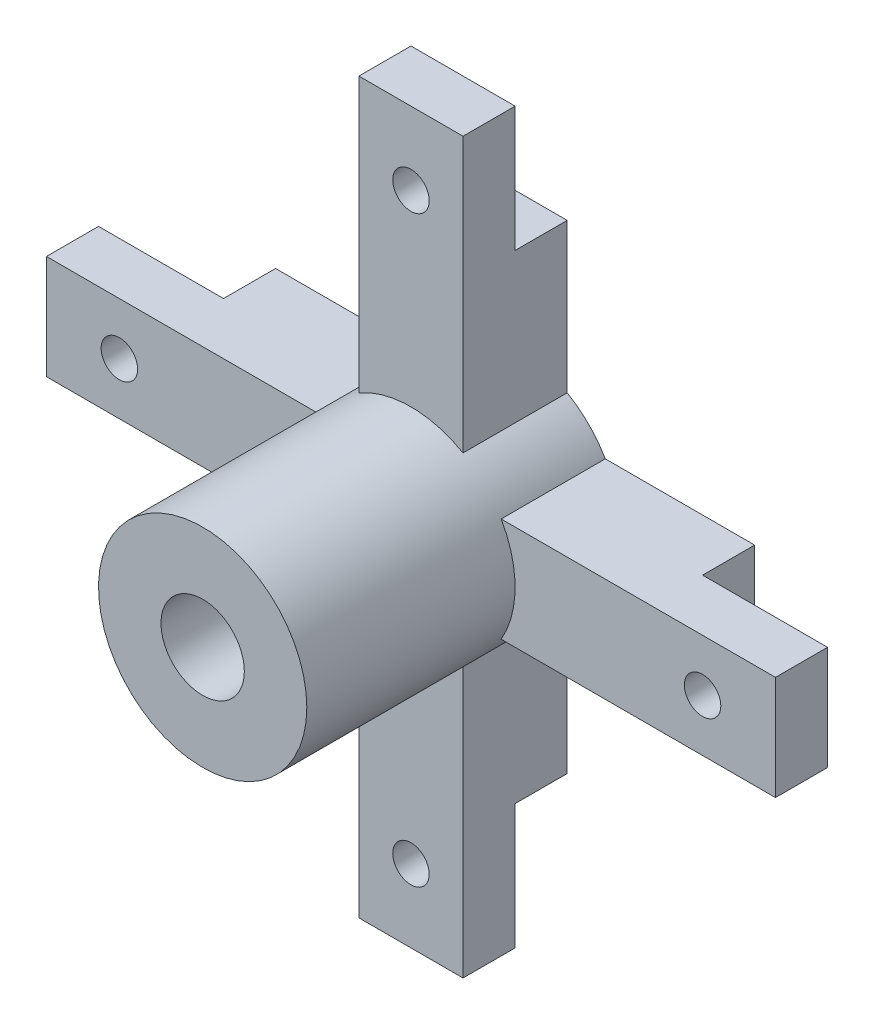
ISO-10303-21;
HEADER;
FILE_DESCRIPTION(('STEP AP214'),'2;1');
FILE_NAME('part.step','',(''),(''),'','','');
FILE_SCHEMA(('AUTOMOTIVE_DESIGN { 1 0 10303 214 1 1 1 1 }'));
ENDSEC;
DATA;
#1=APPLICATION_CONTEXT('core data for automotive mechanical design processes');
#2=APPLICATION_PROTOCOL_DEFINITION('international standard','automotive_design',2000,#1);
#3=PRODUCT_CONTEXT('',#1,'mechanical');
#4=PRODUCT('Part','Part','',(#3));
#5=PRODUCT_RELATED_PRODUCT_CATEGORY('part','',(#4));
#6=PRODUCT_DEFINITION_FORMATION('','',#4);
#7=PRODUCT_DEFINITION_CONTEXT('part definition',#1,'design');
#8=PRODUCT_DEFINITION('design','',#6,#7);
#9=PRODUCT_DEFINITION_SHAPE('','',#8);
#10=(LENGTH_UNIT() NAMED_UNIT(*) SI_UNIT(.MILLI.,.METRE.));
#11=(NAMED_UNIT(*) PLANE_ANGLE_UNIT() SI_UNIT($,.RADIAN.));
#12=(NAMED_UNIT(*) SI_UNIT($,.STERADIAN.) SOLID_ANGLE_UNIT());
#13=UNCERTAINTY_MEASURE_WITH_UNIT(LENGTH_MEASURE(1.E-05),#10,'distance_accuracy_value','');
#14=(GEOMETRIC_REPRESENTATION_CONTEXT(3) GLOBAL_UNCERTAINTY_ASSIGNED_CONTEXT((#13)) GLOBAL_UNIT_ASSIGNED_CONTEXT((#10,
#11,#12)) REPRESENTATION_CONTEXT('',''));
#15=CARTESIAN_POINT('',(0.,0.,0.));
#16=DIRECTION('',(0.,0.,1.));
#17=DIRECTION('',(1.,0.,0.));
#18=AXIS2_PLACEMENT_3D('',#15,#16,#17);
#19=CARTESIAN_POINT('',(0.,0.,30.));
#20=DIRECTION('',(0.,0.,1.));
#21=DIRECTION('',(1.,0.,0.));
#22=AXIS2_PLACEMENT_3D('',#19,#20,#21);
#23=PLANE('',#22);
#24=CARTESIAN_POINT('',(0.,0.,30.));
#25=DIRECTION('',(0.,0.,1.));
#26=DIRECTION('',(1.,0.,0.));
#27=AXIS2_PLACEMENT_3D('',#24,#25,#26);
#28=CIRCLE('',#27,10.);
#29=CARTESIAN_POINT('',(10.,0.,30.));
#30=VERTEX_POINT('',#29);
#31=EDGE_CURVE('E298',#30,#30,#28,.T.);
#32=ORIENTED_EDGE('',*,*,#31,.T.);
#33=EDGE_LOOP('',(#32));
#34=FACE_BOUND('',#33,.T.);
#35=CARTESIAN_POINT('',(0.,0.,30.));
#36=DIRECTION('',(0.,0.,1.));
#37=DIRECTION('',(1.,0.,0.));
#38=AXIS2_PLACEMENT_3D('',#35,#36,#37);
#39=CIRCLE('',#38,4.);
#40=CARTESIAN_POINT('',(4.,0.,30.));
#41=VERTEX_POINT('',#40);
#42=EDGE_CURVE('E292',#41,#41,#39,.T.);
#43=ORIENTED_EDGE('',*,*,#42,.F.);
#44=EDGE_LOOP('',(#43));
#45=FACE_BOUND('',#44,.T.);
#46=ADVANCED_FACE('F35',(#34,#45),#23,.T.);
#47=CARTESIAN_POINT('',(0.,0.,0.));
#48=DIRECTION('',(0.,0.,1.));
#49=DIRECTION('',(1.,0.,0.));
#50=AXIS2_PLACEMENT_3D('',#47,#48,#49);
#51=PLANE('',#50);
#52=CARTESIAN_POINT('',(0.,0.,0.));
#53=DIRECTION('',(0.,0.,1.));
#54=DIRECTION('',(1.,0.,0.));
#55=AXIS2_PLACEMENT_3D('',#52,#53,#54);
#56=CIRCLE('',#55,4.);
#57=CARTESIAN_POINT('',(4.,0.,0.));
#58=VERTEX_POINT('',#57);
#59=EDGE_CURVE('E291',#58,#58,#56,.T.);
#60=ORIENTED_EDGE('',*,*,#59,.T.);
#61=EDGE_LOOP('',(#60));
#62=FACE_BOUND('',#61,.T.);
#63=DIRECTION('',(0.,-1.,0.));
#64=VECTOR('',#63,1.);
#65=CARTESIAN_POINT('',(5.,-4.,0.));
#66=LINE('',#65,#64);
#67=CARTESIAN_POINT('',(5.,-8.66025403784439,0.));
#68=VERTEX_POINT('',#67);
#69=CARTESIAN_POINT('',(5.,-23.,0.));
#70=VERTEX_POINT('',#69);
#71=EDGE_CURVE('E411',#68,#70,#66,.T.);
#72=ORIENTED_EDGE('',*,*,#71,.T.);
#73=DIRECTION('',(1.,0.,0.));
#74=VECTOR('',#73,1.);
#75=CARTESIAN_POINT('',(-5.,-23.,0.));
#76=LINE('',#75,#74);
#77=CARTESIAN_POINT('',(-5.,-23.,0.));
#78=VERTEX_POINT('',#77);
#79=EDGE_CURVE('E203',#78,#70,#76,.T.);
#80=ORIENTED_EDGE('',*,*,#79,.F.);
#81=DIRECTION('',(0.,1.,0.));
#82=VECTOR('',#81,1.);
#83=CARTESIAN_POINT('',(-5.,-4.,0.));
#84=LINE('',#83,#82);
#85=CARTESIAN_POINT('',(-5.,-8.66025403784439,0.));
#86=VERTEX_POINT('',#85);
#87=EDGE_CURVE('E415',#78,#86,#84,.T.);
#88=ORIENTED_EDGE('',*,*,#87,.T.);
#89=CARTESIAN_POINT('',(0.,0.,0.));
#90=DIRECTION('',(0.,0.,1.));
#91=DIRECTION('',(1.,0.,0.));
#92=AXIS2_PLACEMENT_3D('',#89,#90,#91);
#93=CIRCLE('',#92,10.);
#94=CARTESIAN_POINT('',(-8.66025403784437,-5.00000000000003,0.));
#95=VERTEX_POINT('',#94);
#96=EDGE_CURVE('E305',#95,#86,#93,.T.);
#97=ORIENTED_EDGE('',*,*,#96,.F.);
#98=DIRECTION('',(-1.,0.,0.));
#99=VECTOR('',#98,1.);
#100=CARTESIAN_POINT('',(-3.99999999999998,-5.00000000000001,0.));
#101=LINE('',#100,#99);
#102=CARTESIAN_POINT('',(-23.,-5.00000000000008,0.));
#103=VERTEX_POINT('',#102);
#104=EDGE_CURVE('E220',#95,#103,#101,.T.);
#105=ORIENTED_EDGE('',*,*,#104,.T.);
#106=DIRECTION('',(0.,-1.,0.));
#107=VECTOR('',#106,1.);
#108=CARTESIAN_POINT('',(-23.,4.99999999999992,0.));
#109=LINE('',#108,#107);
#110=CARTESIAN_POINT('',(-23.,4.99999999999992,0.));
#111=VERTEX_POINT('',#110);
#112=EDGE_CURVE('E384',#111,#103,#109,.T.);
#113=ORIENTED_EDGE('',*,*,#112,.F.);
#114=DIRECTION('',(1.,0.,0.));
#115=VECTOR('',#114,1.);
#116=CARTESIAN_POINT('',(-4.00000000000002,4.99999999999999,0.));
#117=LINE('',#116,#115);
#118=CARTESIAN_POINT('',(-8.6602540378444,4.99999999999997,0.));
#119=VERTEX_POINT('',#118);
#120=EDGE_CURVE('E229',#111,#119,#117,.T.);
#121=ORIENTED_EDGE('',*,*,#120,.T.);
#122=CARTESIAN_POINT('',(-5.,8.66025403784439,0.));
#123=VERTEX_POINT('',#122);
#124=EDGE_CURVE('E302',#123,#119,#93,.T.);
#125=ORIENTED_EDGE('',*,*,#124,.F.);
#126=DIRECTION('',(0.,1.,0.));
#127=VECTOR('',#126,1.);
#128=CARTESIAN_POINT('',(-5.,4.,0.));
#129=LINE('',#128,#127);
#130=CARTESIAN_POINT('',(-5.,23.,0.));
#131=VERTEX_POINT('',#130);
#132=EDGE_CURVE('E268',#123,#131,#129,.T.);
#133=ORIENTED_EDGE('',*,*,#132,.T.);
#134=DIRECTION('',(-1.,0.,0.));
#135=VECTOR('',#134,1.);
#136=CARTESIAN_POINT('',(5.,23.,0.));
#137=LINE('',#136,#135);
#138=CARTESIAN_POINT('',(5.,23.,0.));
#139=VERTEX_POINT('',#138);
#140=EDGE_CURVE('E256',#139,#131,#137,.T.);
#141=ORIENTED_EDGE('',*,*,#140,.F.);
#142=DIRECTION('',(0.,-1.,0.));
#143=VECTOR('',#142,1.);
#144=CARTESIAN_POINT('',(5.,4.,0.));
#145=LINE('',#144,#143);
#146=CARTESIAN_POINT('',(5.,8.66025403784439,0.));
#147=VERTEX_POINT('',#146);
#148=EDGE_CURVE('E273',#139,#147,#145,.T.);
#149=ORIENTED_EDGE('',*,*,#148,.T.);
#150=CARTESIAN_POINT('',(8.66025403784433,5.00000000000009,0.));
#151=VERTEX_POINT('',#150);
#152=EDGE_CURVE('E295',#151,#147,#93,.T.);
#153=ORIENTED_EDGE('',*,*,#152,.F.);
#154=DIRECTION('',(1.,0.,0.));
#155=VECTOR('',#154,1.);
#156=CARTESIAN_POINT('',(3.99999999999995,5.00000000000004,0.));
#157=LINE('',#156,#155);
#158=CARTESIAN_POINT('',(22.9999999999999,5.00000000000024,0.));
#159=VERTEX_POINT('',#158);
#160=EDGE_CURVE('E391',#151,#159,#157,.T.);
#161=ORIENTED_EDGE('',*,*,#160,.T.);
#162=DIRECTION('',(0.,1.,0.));
#163=VECTOR('',#162,1.);
#164=CARTESIAN_POINT('',(23.0000000000001,-4.99999999999976,0.));
#165=LINE('',#164,#163);
#166=CARTESIAN_POINT('',(23.0000000000001,-4.99999999999976,0.));
#167=VERTEX_POINT('',#166);
#168=EDGE_CURVE('E429',#167,#159,#165,.T.);
#169=ORIENTED_EDGE('',*,*,#168,.F.);
#170=DIRECTION('',(-1.,0.,0.));
#171=VECTOR('',#170,1.);
#172=CARTESIAN_POINT('',(4.00000000000005,-4.99999999999996,0.));
#173=LINE('',#172,#171);
#174=CARTESIAN_POINT('',(8.66025403784444,-4.99999999999991,0.));
#175=VERTEX_POINT('',#174);
#176=EDGE_CURVE('E400',#167,#175,#173,.T.);
#177=ORIENTED_EDGE('',*,*,#176,.T.);
#178=EDGE_CURVE('E354',#68,#175,#93,.T.);
#179=ORIENTED_EDGE('',*,*,#178,.F.);
#180=EDGE_LOOP('',(#72,#80,#88,#97,#105,#113,#121,#125,#133,#141,#149,#153,#161,#169,#177,#179));
#181=FACE_BOUND('',#180,.T.);
#182=ADVANCED_FACE('F364',(#62,#181),#51,.F.);
#183=CARTESIAN_POINT('',(0.,0.,30.));
#184=DIRECTION('',(0.,0.,-1.));
#185=DIRECTION('',(-1.,0.,0.));
#186=AXIS2_PLACEMENT_3D('',#183,#184,#185);
#187=CYLINDRICAL_SURFACE('',#186,10.);
#188=ORIENTED_EDGE('',*,*,#31,.F.);
#189=EDGE_LOOP('',(#188));
#190=FACE_BOUND('',#189,.T.);
#191=CARTESIAN_POINT('',(0.,0.,10.));
#192=DIRECTION('',(0.,0.,1.));
#193=DIRECTION('',(1.,0.,0.));
#194=AXIS2_PLACEMENT_3D('',#191,#192,#193);
#195=CIRCLE('',#194,10.);
#196=CARTESIAN_POINT('',(-8.6602540378444,4.99999999999997,10.));
#197=VERTEX_POINT('',#196);
#198=CARTESIAN_POINT('',(-8.66025403784437,-5.00000000000003,10.));
#199=VERTEX_POINT('',#198);
#200=EDGE_CURVE('E248',#197,#199,#195,.T.);
#201=ORIENTED_EDGE('',*,*,#200,.T.);
#202=DIRECTION('',(0.,0.,-1.));
#203=VECTOR('',#202,1.);
#204=CARTESIAN_POINT('',(-8.66025403784437,-5.00000000000003,30.));
#205=LINE('',#204,#203);
#206=EDGE_CURVE('E11',#199,#95,#205,.T.);
#207=ORIENTED_EDGE('',*,*,#206,.T.);
#208=ORIENTED_EDGE('',*,*,#96,.T.);
#209=DIRECTION('',(0.,0.,-1.));
#210=VECTOR('',#209,1.);
#211=CARTESIAN_POINT('',(-5.,-8.66025403784439,30.));
#212=LINE('',#211,#210);
#213=CARTESIAN_POINT('',(-5.,-8.66025403784439,10.));
#214=VERTEX_POINT('',#213);
#215=EDGE_CURVE('E318',#86,#214,#212,.F.);
#216=ORIENTED_EDGE('',*,*,#215,.T.);
#217=CARTESIAN_POINT('',(5.,-8.66025403784439,10.));
#218=VERTEX_POINT('',#217);
#219=EDGE_CURVE('E247',#214,#218,#195,.T.);
#220=ORIENTED_EDGE('',*,*,#219,.T.);
#221=DIRECTION('',(0.,0.,-1.));
#222=VECTOR('',#221,1.);
#223=CARTESIAN_POINT('',(5.,-8.66025403784439,30.));
#224=LINE('',#223,#222);
#225=EDGE_CURVE('E321',#218,#68,#224,.T.);
#226=ORIENTED_EDGE('',*,*,#225,.T.);
#227=ORIENTED_EDGE('',*,*,#178,.T.);
#228=DIRECTION('',(0.,0.,-1.));
#229=VECTOR('',#228,1.);
#230=CARTESIAN_POINT('',(8.66025403784444,-4.99999999999991,30.));
#231=LINE('',#230,#229);
#232=CARTESIAN_POINT('',(8.66025403784444,-4.99999999999991,10.));
#233=VERTEX_POINT('',#232);
#234=EDGE_CURVE('E310',#175,#233,#231,.F.);
#235=ORIENTED_EDGE('',*,*,#234,.T.);
#236=CARTESIAN_POINT('',(8.66025403784433,5.00000000000009,10.));
#237=VERTEX_POINT('',#236);
#238=EDGE_CURVE('E242',#233,#237,#195,.T.);
#239=ORIENTED_EDGE('',*,*,#238,.T.);
#240=DIRECTION('',(0.,0.,-1.));
#241=VECTOR('',#240,1.);
#242=CARTESIAN_POINT('',(8.66025403784433,5.00000000000009,30.));
#243=LINE('',#242,#241);
#244=EDGE_CURVE('E315',#237,#151,#243,.T.);
#245=ORIENTED_EDGE('',*,*,#244,.T.);
#246=ORIENTED_EDGE('',*,*,#152,.T.);
#247=DIRECTION('',(0.,0.,-1.));
#248=VECTOR('',#247,1.);
#249=CARTESIAN_POINT('',(5.,8.66025403784439,30.));
#250=LINE('',#249,#248);
#251=CARTESIAN_POINT('',(5.,8.66025403784439,10.));
#252=VERTEX_POINT('',#251);
#253=EDGE_CURVE('E301',#147,#252,#250,.F.);
#254=ORIENTED_EDGE('',*,*,#253,.T.);
#255=CARTESIAN_POINT('',(0.,0.,10.));
#256=DIRECTION('',(0.,0.,1.));
#257=DIRECTION('',(1.,0.,0.));
#258=AXIS2_PLACEMENT_3D('',#255,#256,#257);
#259=CIRCLE('',#258,10.);
#260=CARTESIAN_POINT('',(-5.,8.66025403784439,10.));
#261=VERTEX_POINT('',#260);
#262=EDGE_CURVE('E287',#252,#261,#259,.T.);
#263=ORIENTED_EDGE('',*,*,#262,.T.);
#264=DIRECTION('',(0.,0.,-1.));
#265=VECTOR('',#264,1.);
#266=CARTESIAN_POINT('',(-5.,8.66025403784439,30.));
#267=LINE('',#266,#265);
#268=EDGE_CURVE('E307',#261,#123,#267,.T.);
#269=ORIENTED_EDGE('',*,*,#268,.T.);
#270=ORIENTED_EDGE('',*,*,#124,.T.);
#271=DIRECTION('',(0.,0.,-1.));
#272=VECTOR('',#271,1.);
#273=CARTESIAN_POINT('',(-8.6602540378444,4.99999999999997,30.));
#274=LINE('',#273,#272);
#275=EDGE_CURVE('E44',#119,#197,#274,.F.);
#276=ORIENTED_EDGE('',*,*,#275,.T.);
#277=EDGE_LOOP('',(#201,#207,#208,#216,#220,#226,#227,#235,#239,#245,#246,#254,#263,#269,#270,#276));
#278=FACE_BOUND('',#277,.T.);
#279=ADVANCED_FACE('F37',(#190,#278),#187,.T.);
#280=CARTESIAN_POINT('',(0.,0.,30.));
#281=DIRECTION('',(0.,0.,-1.));
#282=DIRECTION('',(-1.,0.,0.));
#283=AXIS2_PLACEMENT_3D('',#280,#281,#282);
#284=CYLINDRICAL_SURFACE('',#283,4.);
#285=ORIENTED_EDGE('',*,*,#59,.F.);
#286=EDGE_LOOP('',(#285));
#287=FACE_BOUND('',#286,.T.);
#288=ORIENTED_EDGE('',*,*,#42,.T.);
#289=EDGE_LOOP('',(#288));
#290=FACE_BOUND('',#289,.T.);
#291=ADVANCED_FACE('F514',(#287,#290),#284,.F.);
#292=CARTESIAN_POINT('',(-5.,4.,10.));
#293=DIRECTION('',(-1.,0.,0.));
#294=DIRECTION('',(0.,0.,1.));
#295=AXIS2_PLACEMENT_3D('',#292,#293,#294);
#296=PLANE('',#295);
#297=DIRECTION('',(0.,0.,-1.));
#298=VECTOR('',#297,1.);
#299=CARTESIAN_POINT('',(-5.,23.,5.));
#300=LINE('',#299,#298);
#301=CARTESIAN_POINT('',(-5.,23.,5.));
#302=VERTEX_POINT('',#301);
#303=EDGE_CURVE('E265',#302,#131,#300,.T.);
#304=ORIENTED_EDGE('',*,*,#303,.T.);
#305=ORIENTED_EDGE('',*,*,#132,.F.);
#306=ORIENTED_EDGE('',*,*,#268,.F.);
#307=DIRECTION('',(0.,1.,0.));
#308=VECTOR('',#307,1.);
#309=CARTESIAN_POINT('',(-5.,4.,10.));
#310=LINE('',#309,#308);
#311=CARTESIAN_POINT('',(-5.,35.,10.));
#312=VERTEX_POINT('',#311);
#313=EDGE_CURVE('E270',#261,#312,#310,.T.);
#314=ORIENTED_EDGE('',*,*,#313,.T.);
#315=DIRECTION('',(0.,0.,-1.));
#316=VECTOR('',#315,1.);
#317=CARTESIAN_POINT('',(-5.,35.,10.));
#318=LINE('',#317,#316);
#319=CARTESIAN_POINT('',(-5.,35.,5.));
#320=VERTEX_POINT('',#319);
#321=EDGE_CURVE('E279',#312,#320,#318,.T.);
#322=ORIENTED_EDGE('',*,*,#321,.T.);
#323=DIRECTION('',(0.,1.,0.));
#324=VECTOR('',#323,1.);
#325=CARTESIAN_POINT('',(-5.,23.,5.));
#326=LINE('',#325,#324);
#327=EDGE_CURVE('E253',#302,#320,#326,.T.);
#328=ORIENTED_EDGE('',*,*,#327,.F.);
#329=EDGE_LOOP('',(#304,#305,#306,#314,#322,#328));
#330=FACE_BOUND('',#329,.T.);
#331=ADVANCED_FACE('F380',(#330),#296,.T.);
#332=CARTESIAN_POINT('',(5.,4.,10.));
#333=DIRECTION('',(1.,0.,0.));
#334=DIRECTION('',(0.,0.,-1.));
#335=AXIS2_PLACEMENT_3D('',#332,#333,#334);
#336=PLANE('',#335);
#337=DIRECTION('',(0.,0.,-1.));
#338=VECTOR('',#337,1.);
#339=CARTESIAN_POINT('',(5.,23.,5.));
#340=LINE('',#339,#338);
#341=CARTESIAN_POINT('',(5.,23.,5.));
#342=VERTEX_POINT('',#341);
#343=EDGE_CURVE('E263',#342,#139,#340,.T.);
#344=ORIENTED_EDGE('',*,*,#343,.F.);
#345=DIRECTION('',(0.,-1.,0.));
#346=VECTOR('',#345,1.);
#347=CARTESIAN_POINT('',(5.,23.,5.));
#348=LINE('',#347,#346);
#349=CARTESIAN_POINT('',(5.,35.,5.));
#350=VERTEX_POINT('',#349);
#351=EDGE_CURVE('E258',#350,#342,#348,.T.);
#352=ORIENTED_EDGE('',*,*,#351,.F.);
#353=DIRECTION('',(0.,0.,-1.));
#354=VECTOR('',#353,1.);
#355=CARTESIAN_POINT('',(5.,35.,10.));
#356=LINE('',#355,#354);
#357=CARTESIAN_POINT('',(5.,35.,10.));
#358=VERTEX_POINT('',#357);
#359=EDGE_CURVE('E284',#358,#350,#356,.T.);
#360=ORIENTED_EDGE('',*,*,#359,.F.);
#361=DIRECTION('',(0.,-1.,0.));
#362=VECTOR('',#361,1.);
#363=CARTESIAN_POINT('',(5.,4.,10.));
#364=LINE('',#363,#362);
#365=EDGE_CURVE('E276',#358,#252,#364,.T.);
#366=ORIENTED_EDGE('',*,*,#365,.T.);
#367=ORIENTED_EDGE('',*,*,#253,.F.);
#368=ORIENTED_EDGE('',*,*,#148,.F.);
#369=EDGE_LOOP('',(#344,#352,#360,#366,#367,#368));
#370=FACE_BOUND('',#369,.T.);
#371=ADVANCED_FACE('F367',(#370),#336,.T.);
#372=CARTESIAN_POINT('',(5.,35.,10.));
#373=DIRECTION('',(0.,1.,0.));
#374=DIRECTION('',(0.,0.,1.));
#375=AXIS2_PLACEMENT_3D('',#372,#373,#374);
#376=PLANE('',#375);
#377=DIRECTION('',(1.,0.,0.));
#378=VECTOR('',#377,1.);
#379=CARTESIAN_POINT('',(5.,35.,5.));
#380=LINE('',#379,#378);
#381=EDGE_CURVE('E255',#320,#350,#380,.T.);
#382=ORIENTED_EDGE('',*,*,#381,.F.);
#383=ORIENTED_EDGE('',*,*,#321,.F.);
#384=DIRECTION('',(1.,0.,0.));
#385=VECTOR('',#384,1.);
#386=CARTESIAN_POINT('',(5.,35.,10.));
#387=LINE('',#386,#385);
#388=EDGE_CURVE('E272',#312,#358,#387,.T.);
#389=ORIENTED_EDGE('',*,*,#388,.T.);
#390=ORIENTED_EDGE('',*,*,#359,.T.);
#391=EDGE_LOOP('',(#382,#383,#389,#390));
#392=FACE_BOUND('',#391,.T.);
#393=ADVANCED_FACE('F377',(#392),#376,.T.);
#394=CARTESIAN_POINT('',(0.,0.,10.));
#395=DIRECTION('',(0.,0.,1.));
#396=DIRECTION('',(1.,0.,0.));
#397=AXIS2_PLACEMENT_3D('',#394,#395,#396);
#398=PLANE('',#397);
#399=CARTESIAN_POINT('',(0.,28.,10.));
#400=DIRECTION('',(0.,0.,1.));
#401=DIRECTION('',(1.,0.,0.));
#402=AXIS2_PLACEMENT_3D('',#399,#400,#401);
#403=CIRCLE('',#402,1.74999999999999);
#404=CARTESIAN_POINT('',(1.74999999999999,28.,10.));
#405=VERTEX_POINT('',#404);
#406=EDGE_CURVE('E252',#405,#405,#403,.T.);
#407=ORIENTED_EDGE('',*,*,#406,.F.);
#408=EDGE_LOOP('',(#407));
#409=FACE_BOUND('',#408,.T.);
#410=ORIENTED_EDGE('',*,*,#262,.F.);
#411=ORIENTED_EDGE('',*,*,#365,.F.);
#412=ORIENTED_EDGE('',*,*,#388,.F.);
#413=ORIENTED_EDGE('',*,*,#313,.F.);
#414=EDGE_LOOP('',(#410,#411,#412,#413));
#415=FACE_BOUND('',#414,.T.);
#416=ADVANCED_FACE('F372',(#409,#415),#398,.T.);
#417=CARTESIAN_POINT('',(5.,23.,5.));
#418=DIRECTION('',(0.,-1.,0.));
#419=DIRECTION('',(0.,0.,-1.));
#420=AXIS2_PLACEMENT_3D('',#417,#418,#419);
#421=PLANE('',#420);
#422=ORIENTED_EDGE('',*,*,#140,.T.);
#423=ORIENTED_EDGE('',*,*,#303,.F.);
#424=DIRECTION('',(-1.,0.,0.));
#425=VECTOR('',#424,1.);
#426=CARTESIAN_POINT('',(5.,23.,5.));
#427=LINE('',#426,#425);
#428=EDGE_CURVE('E260',#342,#302,#427,.T.);
#429=ORIENTED_EDGE('',*,*,#428,.F.);
#430=ORIENTED_EDGE('',*,*,#343,.T.);
#431=EDGE_LOOP('',(#422,#423,#429,#430));
#432=FACE_BOUND('',#431,.T.);
#433=ADVANCED_FACE('F526',(#432),#421,.F.);
#434=CARTESIAN_POINT('',(0.,0.,5.));
#435=DIRECTION('',(0.,0.,1.));
#436=DIRECTION('',(1.,0.,0.));
#437=AXIS2_PLACEMENT_3D('',#434,#435,#436);
#438=PLANE('',#437);
#439=CARTESIAN_POINT('',(0.,28.,5.));
#440=DIRECTION('',(0.,0.,-1.));
#441=DIRECTION('',(-1.,0.,0.));
#442=AXIS2_PLACEMENT_3D('',#439,#440,#441);
#443=CIRCLE('',#442,1.74999999999999);
#444=CARTESIAN_POINT('',(-1.74999999999999,28.,5.));
#445=VERTEX_POINT('',#444);
#446=EDGE_CURVE('E249',#445,#445,#443,.T.);
#447=ORIENTED_EDGE('',*,*,#446,.F.);
#448=EDGE_LOOP('',(#447));
#449=FACE_BOUND('',#448,.T.);
#450=ORIENTED_EDGE('',*,*,#327,.T.);
#451=ORIENTED_EDGE('',*,*,#381,.T.);
#452=ORIENTED_EDGE('',*,*,#351,.T.);
#453=ORIENTED_EDGE('',*,*,#428,.T.);
#454=EDGE_LOOP('',(#450,#451,#452,#453));
#455=FACE_BOUND('',#454,.T.);
#456=ADVANCED_FACE('F530',(#449,#455),#438,.F.);
#457=CARTESIAN_POINT('',(0.,28.,5.));
#458=DIRECTION('',(0.,0.,-1.));
#459=DIRECTION('',(-1.,0.,0.));
#460=AXIS2_PLACEMENT_3D('',#457,#458,#459);
#461=CYLINDRICAL_SURFACE('',#460,1.74999999999999);
#462=ORIENTED_EDGE('',*,*,#406,.T.);
#463=EDGE_LOOP('',(#462));
#464=FACE_BOUND('',#463,.T.);
#465=ORIENTED_EDGE('',*,*,#446,.T.);
#466=EDGE_LOOP('',(#465));
#467=FACE_BOUND('',#466,.T.);
#468=ADVANCED_FACE('F534',(#464,#467),#461,.F.);
#469=CARTESIAN_POINT('',(35.0000000000001,-4.99999999999963,10.));
#470=DIRECTION('',(1.,0.,0.));
#471=DIRECTION('',(0.,1.,0.));
#472=AXIS2_PLACEMENT_3D('',#469,#470,#471);
#473=PLANE('',#472);
#474=DIRECTION('',(0.,-1.,0.));
#475=VECTOR('',#474,1.);
#476=CARTESIAN_POINT('',(35.0000000000001,-4.99999999999963,5.));
#477=LINE('',#476,#475);
#478=CARTESIAN_POINT('',(35.,5.00000000000037,5.));
#479=VERTEX_POINT('',#478);
#480=CARTESIAN_POINT('',(35.0000000000001,-4.99999999999963,5.));
#481=VERTEX_POINT('',#480);
#482=EDGE_CURVE('E51',#479,#481,#477,.T.);
#483=ORIENTED_EDGE('',*,*,#482,.F.);
#484=DIRECTION('',(0.,0.,-1.));
#485=VECTOR('',#484,1.);
#486=CARTESIAN_POINT('',(35.,5.00000000000037,10.));
#487=LINE('',#486,#485);
#488=CARTESIAN_POINT('',(35.,5.00000000000037,10.));
#489=VERTEX_POINT('',#488);
#490=EDGE_CURVE('E405',#489,#479,#487,.T.);
#491=ORIENTED_EDGE('',*,*,#490,.F.);
#492=DIRECTION('',(0.,-1.,0.));
#493=VECTOR('',#492,1.);
#494=CARTESIAN_POINT('',(35.0000000000001,-4.99999999999963,10.));
#495=LINE('',#494,#493);
#496=CARTESIAN_POINT('',(35.0000000000001,-4.99999999999963,10.));
#497=VERTEX_POINT('',#496);
#498=EDGE_CURVE('E399',#489,#497,#495,.T.);
#499=ORIENTED_EDGE('',*,*,#498,.T.);
#500=DIRECTION('',(0.,0.,-1.));
#501=VECTOR('',#500,1.);
#502=CARTESIAN_POINT('',(35.0000000000001,-4.99999999999963,10.));
#503=LINE('',#502,#501);
#504=EDGE_CURVE('E408',#497,#481,#503,.T.);
#505=ORIENTED_EDGE('',*,*,#504,.T.);
#506=EDGE_LOOP('',(#483,#491,#499,#505));
#507=FACE_BOUND('',#506,.T.);
#508=ADVANCED_FACE('F445',(#507),#473,.T.);
#509=CARTESIAN_POINT('',(3.99999999999995,5.00000000000004,10.));
#510=DIRECTION('',(0.,1.,0.));
#511=DIRECTION('',(-1.,0.,0.));
#512=AXIS2_PLACEMENT_3D('',#509,#510,#511);
#513=PLANE('',#512);
#514=DIRECTION('',(0.,0.,-1.));
#515=VECTOR('',#514,1.);
#516=CARTESIAN_POINT('',(22.9999999999999,5.00000000000024,5.));
#517=LINE('',#516,#515);
#518=CARTESIAN_POINT('',(22.9999999999999,5.00000000000024,5.));
#519=VERTEX_POINT('',#518);
#520=EDGE_CURVE('E459',#519,#159,#517,.T.);
#521=ORIENTED_EDGE('',*,*,#520,.T.);
#522=ORIENTED_EDGE('',*,*,#160,.F.);
#523=ORIENTED_EDGE('',*,*,#244,.F.);
#524=DIRECTION('',(1.,0.,0.));
#525=VECTOR('',#524,1.);
#526=CARTESIAN_POINT('',(3.99999999999995,5.00000000000004,10.));
#527=LINE('',#526,#525);
#528=EDGE_CURVE('E397',#237,#489,#527,.T.);
#529=ORIENTED_EDGE('',*,*,#528,.T.);
#530=ORIENTED_EDGE('',*,*,#490,.T.);
#531=DIRECTION('',(1.,0.,0.));
#532=VECTOR('',#531,1.);
#533=CARTESIAN_POINT('',(22.9999999999999,5.00000000000024,5.));
#534=LINE('',#533,#532);
#535=EDGE_CURVE('E447',#519,#479,#534,.T.);
#536=ORIENTED_EDGE('',*,*,#535,.F.);
#537=EDGE_LOOP('',(#521,#522,#523,#529,#530,#536));
#538=FACE_BOUND('',#537,.T.);
#539=ADVANCED_FACE('F442',(#538),#513,.T.);
#540=CARTESIAN_POINT('',(4.00000000000005,-4.99999999999996,10.));
#541=DIRECTION('',(0.,-1.,0.));
#542=DIRECTION('',(1.,0.,0.));
#543=AXIS2_PLACEMENT_3D('',#540,#541,#542);
#544=PLANE('',#543);
#545=DIRECTION('',(0.,0.,-1.));
#546=VECTOR('',#545,1.);
#547=CARTESIAN_POINT('',(23.0000000000001,-4.99999999999976,5.));
#548=LINE('',#547,#546);
#549=CARTESIAN_POINT('',(23.0000000000001,-4.99999999999976,5.));
#550=VERTEX_POINT('',#549);
#551=EDGE_CURVE('E456',#550,#167,#548,.T.);
#552=ORIENTED_EDGE('',*,*,#551,.F.);
#553=DIRECTION('',(-1.,0.,0.));
#554=VECTOR('',#553,1.);
#555=CARTESIAN_POINT('',(23.0000000000001,-4.99999999999976,5.));
#556=LINE('',#555,#554);
#557=EDGE_CURVE('E446',#481,#550,#556,.T.);
#558=ORIENTED_EDGE('',*,*,#557,.F.);
#559=ORIENTED_EDGE('',*,*,#504,.F.);
#560=DIRECTION('',(-1.,0.,0.));
#561=VECTOR('',#560,1.);
#562=CARTESIAN_POINT('',(4.00000000000005,-4.99999999999996,10.));
#563=LINE('',#562,#561);
#564=EDGE_CURVE('E403',#497,#233,#563,.T.);
#565=ORIENTED_EDGE('',*,*,#564,.T.);
#566=ORIENTED_EDGE('',*,*,#234,.F.);
#567=ORIENTED_EDGE('',*,*,#176,.F.);
#568=EDGE_LOOP('',(#552,#558,#559,#565,#566,#567));
#569=FACE_BOUND('',#568,.T.);
#570=ADVANCED_FACE('F432',(#569),#544,.T.);
#571=CARTESIAN_POINT('',(0.,0.,10.));
#572=DIRECTION('',(0.,0.,1.));
#573=DIRECTION('',(0.,1.,0.));
#574=AXIS2_PLACEMENT_3D('',#571,#572,#573);
#575=PLANE('',#574);
#576=CARTESIAN_POINT('',(28.,2.93284432462823E-13,10.));
#577=DIRECTION('',(0.,0.,1.));
#578=DIRECTION('',(1.,0.,0.));
#579=AXIS2_PLACEMENT_3D('',#576,#577,#578);
#580=CIRCLE('',#579,1.74999999999999);
#581=CARTESIAN_POINT('',(29.75,2.93284432462823E-13,10.));
#582=VERTEX_POINT('',#581);
#583=EDGE_CURVE('E39',#582,#582,#580,.T.);
#584=ORIENTED_EDGE('',*,*,#583,.F.);
#585=EDGE_LOOP('',(#584));
#586=FACE_BOUND('',#585,.T.);
#587=ORIENTED_EDGE('',*,*,#238,.F.);
#588=ORIENTED_EDGE('',*,*,#564,.F.);
#589=ORIENTED_EDGE('',*,*,#498,.F.);
#590=ORIENTED_EDGE('',*,*,#528,.F.);
#591=EDGE_LOOP('',(#587,#588,#589,#590));
#592=FACE_BOUND('',#591,.T.);
#593=ADVANCED_FACE('F437',(#586,#592),#575,.T.);
#594=CARTESIAN_POINT('',(-5.,-35.,10.));
#595=DIRECTION('',(0.,-1.,0.));
#596=DIRECTION('',(0.,0.,-1.));
#597=AXIS2_PLACEMENT_3D('',#594,#595,#596);
#598=PLANE('',#597);
#599=DIRECTION('',(-1.,0.,0.));
#600=VECTOR('',#599,1.);
#601=CARTESIAN_POINT('',(-5.,-35.,5.));
#602=LINE('',#601,#600);
#603=CARTESIAN_POINT('',(5.,-35.,5.));
#604=VERTEX_POINT('',#603);
#605=CARTESIAN_POINT('',(-5.,-35.,5.));
#606=VERTEX_POINT('',#605);
#607=EDGE_CURVE('E59',#604,#606,#602,.T.);
#608=ORIENTED_EDGE('',*,*,#607,.F.);
#609=DIRECTION('',(0.,0.,-1.));
#610=VECTOR('',#609,1.);
#611=CARTESIAN_POINT('',(5.,-35.,10.));
#612=LINE('',#611,#610);
#613=CARTESIAN_POINT('',(5.,-35.,10.));
#614=VERTEX_POINT('',#613);
#615=EDGE_CURVE('E210',#614,#604,#612,.T.);
#616=ORIENTED_EDGE('',*,*,#615,.F.);
#617=DIRECTION('',(-1.,0.,0.));
#618=VECTOR('',#617,1.);
#619=CARTESIAN_POINT('',(-5.,-35.,10.));
#620=LINE('',#619,#618);
#621=CARTESIAN_POINT('',(-5.,-35.,10.));
#622=VERTEX_POINT('',#621);
#623=EDGE_CURVE('E222',#614,#622,#620,.T.);
#624=ORIENTED_EDGE('',*,*,#623,.T.);
#625=DIRECTION('',(0.,0.,-1.));
#626=VECTOR('',#625,1.);
#627=CARTESIAN_POINT('',(-5.,-35.,10.));
#628=LINE('',#627,#626);
#629=EDGE_CURVE('E212',#622,#606,#628,.T.);
#630=ORIENTED_EDGE('',*,*,#629,.T.);
#631=EDGE_LOOP('',(#608,#616,#624,#630));
#632=FACE_BOUND('',#631,.T.);
#633=ADVANCED_FACE('F208',(#632),#598,.T.);
#634=CARTESIAN_POINT('',(5.,-4.,10.));
#635=DIRECTION('',(1.,0.,0.));
#636=DIRECTION('',(0.,0.,-1.));
#637=AXIS2_PLACEMENT_3D('',#634,#635,#636);
#638=PLANE('',#637);
#639=DIRECTION('',(0.,0.,-1.));
#640=VECTOR('',#639,1.);
#641=CARTESIAN_POINT('',(5.,-23.,5.));
#642=LINE('',#641,#640);
#643=CARTESIAN_POINT('',(5.,-23.,5.));
#644=VERTEX_POINT('',#643);
#645=EDGE_CURVE('E464',#644,#70,#642,.T.);
#646=ORIENTED_EDGE('',*,*,#645,.T.);
#647=ORIENTED_EDGE('',*,*,#71,.F.);
#648=ORIENTED_EDGE('',*,*,#225,.F.);
#649=DIRECTION('',(0.,-1.,0.));
#650=VECTOR('',#649,1.);
#651=CARTESIAN_POINT('',(5.,-4.,10.));
#652=LINE('',#651,#650);
#653=EDGE_CURVE('E217',#218,#614,#652,.T.);
#654=ORIENTED_EDGE('',*,*,#653,.T.);
#655=ORIENTED_EDGE('',*,*,#615,.T.);
#656=DIRECTION('',(0.,-1.,0.));
#657=VECTOR('',#656,1.);
#658=CARTESIAN_POINT('',(5.,-23.,5.));
#659=LINE('',#658,#657);
#660=EDGE_CURVE('E196',#644,#604,#659,.T.);
#661=ORIENTED_EDGE('',*,*,#660,.F.);
#662=EDGE_LOOP('',(#646,#647,#648,#654,#655,#661));
#663=FACE_BOUND('',#662,.T.);
#664=ADVANCED_FACE('F215',(#663),#638,.T.);
#665=CARTESIAN_POINT('',(-5.,-4.,10.));
#666=DIRECTION('',(-1.,0.,0.));
#667=DIRECTION('',(0.,0.,1.));
#668=AXIS2_PLACEMENT_3D('',#665,#666,#667);
#669=PLANE('',#668);
#670=DIRECTION('',(0.,0.,-1.));
#671=VECTOR('',#670,1.);
#672=CARTESIAN_POINT('',(-5.,-23.,5.));
#673=LINE('',#672,#671);
#674=CARTESIAN_POINT('',(-5.,-23.,5.));
#675=VERTEX_POINT('',#674);
#676=EDGE_CURVE('E465',#675,#78,#673,.T.);
#677=ORIENTED_EDGE('',*,*,#676,.F.);
#678=DIRECTION('',(0.,1.,0.));
#679=VECTOR('',#678,1.);
#680=CARTESIAN_POINT('',(-5.,-23.,5.));
#681=LINE('',#680,#679);
#682=EDGE_CURVE('E213',#606,#675,#681,.T.);
#683=ORIENTED_EDGE('',*,*,#682,.F.);
#684=ORIENTED_EDGE('',*,*,#629,.F.);
#685=DIRECTION('',(0.,1.,0.));
#686=VECTOR('',#685,1.);
#687=CARTESIAN_POINT('',(-5.,-4.,10.));
#688=LINE('',#687,#686);
#689=EDGE_CURVE('E218',#622,#214,#688,.T.);
#690=ORIENTED_EDGE('',*,*,#689,.T.);
#691=ORIENTED_EDGE('',*,*,#215,.F.);
#692=ORIENTED_EDGE('',*,*,#87,.F.);
#693=EDGE_LOOP('',(#677,#683,#684,#690,#691,#692));
#694=FACE_BOUND('',#693,.T.);
#695=ADVANCED_FACE('F421',(#694),#669,.T.);
#696=CARTESIAN_POINT('',(0.,-28.,10.));
#697=DIRECTION('',(0.,0.,1.));
#698=DIRECTION('',(1.,0.,0.));
#699=AXIS2_PLACEMENT_3D('',#696,#697,#698);
#700=CIRCLE('',#699,1.74999999999999);
#701=CARTESIAN_POINT('',(1.74999999999999,-28.,10.));
#702=VERTEX_POINT('',#701);
#703=EDGE_CURVE('E476',#702,#702,#700,.T.);
#704=ORIENTED_EDGE('',*,*,#703,.F.);
#705=EDGE_LOOP('',(#704));
#706=FACE_BOUND('',#705,.T.);
#707=ORIENTED_EDGE('',*,*,#219,.F.);
#708=ORIENTED_EDGE('',*,*,#689,.F.);
#709=ORIENTED_EDGE('',*,*,#623,.F.);
#710=ORIENTED_EDGE('',*,*,#653,.F.);
#711=EDGE_LOOP('',(#707,#708,#709,#710));
#712=FACE_BOUND('',#711,.T.);
#713=ADVANCED_FACE('F425',(#706,#712),#575,.T.);
#714=CARTESIAN_POINT('',(-3.99999999999998,-5.00000000000001,10.));
#715=DIRECTION('',(0.,-1.,0.));
#716=DIRECTION('',(1.,0.,0.));
#717=AXIS2_PLACEMENT_3D('',#714,#715,#716);
#718=PLANE('',#717);
#719=DIRECTION('',(0.,0.,-1.));
#720=VECTOR('',#719,1.);
#721=CARTESIAN_POINT('',(-23.,-5.00000000000008,5.));
#722=LINE('',#721,#720);
#723=CARTESIAN_POINT('',(-23.,-5.00000000000008,5.));
#724=VERTEX_POINT('',#723);
#725=EDGE_CURVE('E388',#724,#103,#722,.T.);
#726=ORIENTED_EDGE('',*,*,#725,.T.);
#727=ORIENTED_EDGE('',*,*,#104,.F.);
#728=ORIENTED_EDGE('',*,*,#206,.F.);
#729=DIRECTION('',(-1.,0.,0.));
#730=VECTOR('',#729,1.);
#731=CARTESIAN_POINT('',(-3.99999999999998,-5.00000000000001,10.));
#732=LINE('',#731,#730);
#733=CARTESIAN_POINT('',(-35.,-5.00000000000012,10.));
#734=VERTEX_POINT('',#733);
#735=EDGE_CURVE('E226',#199,#734,#732,.T.);
#736=ORIENTED_EDGE('',*,*,#735,.T.);
#737=DIRECTION('',(0.,0.,-1.));
#738=VECTOR('',#737,1.);
#739=CARTESIAN_POINT('',(-35.,-5.00000000000012,10.));
#740=LINE('',#739,#738);
#741=CARTESIAN_POINT('',(-35.,-5.00000000000012,5.));
#742=VERTEX_POINT('',#741);
#743=EDGE_CURVE('E235',#734,#742,#740,.T.);
#744=ORIENTED_EDGE('',*,*,#743,.T.);
#745=DIRECTION('',(-1.,0.,0.));
#746=VECTOR('',#745,1.);
#747=CARTESIAN_POINT('',(-23.,-5.00000000000008,5.));
#748=LINE('',#747,#746);
#749=EDGE_CURVE('E348',#724,#742,#748,.T.);
#750=ORIENTED_EDGE('',*,*,#749,.F.);
#751=EDGE_LOOP('',(#726,#727,#728,#736,#744,#750));
#752=FACE_BOUND('',#751,.T.);
#753=ADVANCED_FACE('F347',(#752),#718,.T.);
#754=CARTESIAN_POINT('',(-4.00000000000002,4.99999999999999,10.));
#755=DIRECTION('',(0.,1.,0.));
#756=DIRECTION('',(-1.,0.,0.));
#757=AXIS2_PLACEMENT_3D('',#754,#755,#756);
#758=PLANE('',#757);
#759=DIRECTION('',(0.,0.,-1.));
#760=VECTOR('',#759,1.);
#761=CARTESIAN_POINT('',(-23.,4.99999999999992,5.));
#762=LINE('',#761,#760);
#763=CARTESIAN_POINT('',(-23.,4.99999999999992,5.));
#764=VERTEX_POINT('',#763);
#765=EDGE_CURVE('E385',#764,#111,#762,.T.);
#766=ORIENTED_EDGE('',*,*,#765,.F.);
#767=DIRECTION('',(1.,0.,0.));
#768=VECTOR('',#767,1.);
#769=CARTESIAN_POINT('',(-23.,4.99999999999992,5.));
#770=LINE('',#769,#768);
#771=CARTESIAN_POINT('',(-35.,4.99999999999988,5.));
#772=VERTEX_POINT('',#771);
#773=EDGE_CURVE('E338',#772,#764,#770,.T.);
#774=ORIENTED_EDGE('',*,*,#773,.F.);
#775=DIRECTION('',(0.,0.,-1.));
#776=VECTOR('',#775,1.);
#777=CARTESIAN_POINT('',(-35.,4.99999999999988,10.));
#778=LINE('',#777,#776);
#779=CARTESIAN_POINT('',(-35.,4.99999999999988,10.));
#780=VERTEX_POINT('',#779);
#781=EDGE_CURVE('E239',#780,#772,#778,.T.);
#782=ORIENTED_EDGE('',*,*,#781,.F.);
#783=DIRECTION('',(1.,0.,0.));
#784=VECTOR('',#783,1.);
#785=CARTESIAN_POINT('',(-4.00000000000002,4.99999999999999,10.));
#786=LINE('',#785,#784);
#787=EDGE_CURVE('E232',#780,#197,#786,.T.);
#788=ORIENTED_EDGE('',*,*,#787,.T.);
#789=ORIENTED_EDGE('',*,*,#275,.F.);
#790=ORIENTED_EDGE('',*,*,#120,.F.);
#791=EDGE_LOOP('',(#766,#774,#782,#788,#789,#790));
#792=FACE_BOUND('',#791,.T.);
#793=ADVANCED_FACE('F336',(#792),#758,.T.);
#794=CARTESIAN_POINT('',(-28.,0.,10.));
#795=DIRECTION('',(0.,0.,1.));
#796=DIRECTION('',(1.,0.,0.));
#797=AXIS2_PLACEMENT_3D('',#794,#795,#796);
#798=CIRCLE('',#797,1.74999999999999);
#799=CARTESIAN_POINT('',(-26.25,0.,10.));
#800=VERTEX_POINT('',#799);
#801=EDGE_CURVE('E458',#800,#800,#798,.T.);
#802=ORIENTED_EDGE('',*,*,#801,.F.);
#803=EDGE_LOOP('',(#802));
#804=FACE_BOUND('',#803,.T.);
#805=ORIENTED_EDGE('',*,*,#200,.F.);
#806=ORIENTED_EDGE('',*,*,#787,.F.);
#807=DIRECTION('',(0.,1.,0.));
#808=VECTOR('',#807,1.);
#809=CARTESIAN_POINT('',(-35.,4.99999999999988,10.));
#810=LINE('',#809,#808);
#811=EDGE_CURVE('E228',#734,#780,#810,.T.);
#812=ORIENTED_EDGE('',*,*,#811,.F.);
#813=ORIENTED_EDGE('',*,*,#735,.F.);
#814=EDGE_LOOP('',(#805,#806,#812,#813));
#815=FACE_BOUND('',#814,.T.);
#816=ADVANCED_FACE('F333',(#804,#815),#575,.T.);
#817=CARTESIAN_POINT('',(-35.,4.99999999999988,10.));
#818=DIRECTION('',(-1.,0.,0.));
#819=DIRECTION('',(0.,-1.,0.));
#820=AXIS2_PLACEMENT_3D('',#817,#818,#819);
#821=PLANE('',#820);
#822=DIRECTION('',(0.,1.,0.));
#823=VECTOR('',#822,1.);
#824=CARTESIAN_POINT('',(-35.,4.99999999999988,5.));
#825=LINE('',#824,#823);
#826=EDGE_CURVE('E343',#742,#772,#825,.T.);
#827=ORIENTED_EDGE('',*,*,#826,.F.);
#828=ORIENTED_EDGE('',*,*,#743,.F.);
#829=ORIENTED_EDGE('',*,*,#811,.T.);
#830=ORIENTED_EDGE('',*,*,#781,.T.);
#831=EDGE_LOOP('',(#827,#828,#829,#830));
#832=FACE_BOUND('',#831,.T.);
#833=ADVANCED_FACE('F341',(#832),#821,.T.);
#834=CARTESIAN_POINT('',(-23.,4.99999999999992,5.));
#835=DIRECTION('',(1.,0.,0.));
#836=DIRECTION('',(0.,1.,0.));
#837=AXIS2_PLACEMENT_3D('',#834,#835,#836);
#838=PLANE('',#837);
#839=ORIENTED_EDGE('',*,*,#112,.T.);
#840=ORIENTED_EDGE('',*,*,#725,.F.);
#841=DIRECTION('',(0.,-1.,0.));
#842=VECTOR('',#841,1.);
#843=CARTESIAN_POINT('',(-23.,4.99999999999992,5.));
#844=LINE('',#843,#842);
#845=EDGE_CURVE('E389',#764,#724,#844,.T.);
#846=ORIENTED_EDGE('',*,*,#845,.F.);
#847=ORIENTED_EDGE('',*,*,#765,.T.);
#848=EDGE_LOOP('',(#839,#840,#846,#847));
#849=FACE_BOUND('',#848,.T.);
#850=ADVANCED_FACE('F542',(#849),#838,.F.);
#851=CARTESIAN_POINT('',(0.,0.,5.));
#852=DIRECTION('',(0.,0.,1.));
#853=DIRECTION('',(0.,1.,0.));
#854=AXIS2_PLACEMENT_3D('',#851,#852,#853);
#855=PLANE('',#854);
#856=CARTESIAN_POINT('',(-28.,0.,5.));
#857=DIRECTION('',(0.,0.,-1.));
#858=DIRECTION('',(-1.,0.,0.));
#859=AXIS2_PLACEMENT_3D('',#856,#857,#858);
#860=CIRCLE('',#859,1.74999999999999);
#861=CARTESIAN_POINT('',(-29.75,0.,5.));
#862=VERTEX_POINT('',#861);
#863=EDGE_CURVE('E473',#862,#862,#860,.T.);
#864=ORIENTED_EDGE('',*,*,#863,.F.);
#865=EDGE_LOOP('',(#864));
#866=FACE_BOUND('',#865,.T.);
#867=ORIENTED_EDGE('',*,*,#749,.T.);
#868=ORIENTED_EDGE('',*,*,#826,.T.);
#869=ORIENTED_EDGE('',*,*,#773,.T.);
#870=ORIENTED_EDGE('',*,*,#845,.T.);
#871=EDGE_LOOP('',(#867,#868,#869,#870));
#872=FACE_BOUND('',#871,.T.);
#873=ADVANCED_FACE('F562',(#866,#872),#855,.F.);
#874=CARTESIAN_POINT('',(-5.,-23.,5.));
#875=DIRECTION('',(0.,1.,0.));
#876=DIRECTION('',(0.,0.,1.));
#877=AXIS2_PLACEMENT_3D('',#874,#875,#876);
#878=PLANE('',#877);
#879=ORIENTED_EDGE('',*,*,#79,.T.);
#880=ORIENTED_EDGE('',*,*,#645,.F.);
#881=DIRECTION('',(1.,0.,0.));
#882=VECTOR('',#881,1.);
#883=CARTESIAN_POINT('',(-5.,-23.,5.));
#884=LINE('',#883,#882);
#885=EDGE_CURVE('E199',#675,#644,#884,.T.);
#886=ORIENTED_EDGE('',*,*,#885,.F.);
#887=ORIENTED_EDGE('',*,*,#676,.T.);
#888=EDGE_LOOP('',(#879,#880,#886,#887));
#889=FACE_BOUND('',#888,.T.);
#890=ADVANCED_FACE('F569',(#889),#878,.F.);
#891=CARTESIAN_POINT('',(0.,0.,5.));
#892=DIRECTION('',(0.,0.,1.));
#893=DIRECTION('',(-1.,0.,0.));
#894=AXIS2_PLACEMENT_3D('',#891,#892,#893);
#895=PLANE('',#894);
#896=CARTESIAN_POINT('',(0.,-28.,5.));
#897=DIRECTION('',(0.,0.,-1.));
#898=DIRECTION('',(-1.,0.,0.));
#899=AXIS2_PLACEMENT_3D('',#896,#897,#898);
#900=CIRCLE('',#899,1.74999999999999);
#901=CARTESIAN_POINT('',(-1.74999999999999,-28.,5.));
#902=VERTEX_POINT('',#901);
#903=EDGE_CURVE('E479',#902,#902,#900,.T.);
#904=ORIENTED_EDGE('',*,*,#903,.F.);
#905=EDGE_LOOP('',(#904));
#906=FACE_BOUND('',#905,.T.);
#907=ORIENTED_EDGE('',*,*,#660,.T.);
#908=ORIENTED_EDGE('',*,*,#607,.T.);
#909=ORIENTED_EDGE('',*,*,#682,.T.);
#910=ORIENTED_EDGE('',*,*,#885,.T.);
#911=EDGE_LOOP('',(#907,#908,#909,#910));
#912=FACE_BOUND('',#911,.T.);
#913=ADVANCED_FACE('F197',(#906,#912),#895,.F.);
#914=CARTESIAN_POINT('',(23.0000000000001,-4.99999999999976,5.));
#915=DIRECTION('',(-1.,0.,0.));
#916=DIRECTION('',(0.,-1.,0.));
#917=AXIS2_PLACEMENT_3D('',#914,#915,#916);
#918=PLANE('',#917);
#919=ORIENTED_EDGE('',*,*,#168,.T.);
#920=ORIENTED_EDGE('',*,*,#520,.F.);
#921=DIRECTION('',(0.,1.,0.));
#922=VECTOR('',#921,1.);
#923=CARTESIAN_POINT('',(23.0000000000001,-4.99999999999976,5.));
#924=LINE('',#923,#922);
#925=EDGE_CURVE('E449',#550,#519,#924,.T.);
#926=ORIENTED_EDGE('',*,*,#925,.F.);
#927=ORIENTED_EDGE('',*,*,#551,.T.);
#928=EDGE_LOOP('',(#919,#920,#926,#927));
#929=FACE_BOUND('',#928,.T.);
#930=ADVANCED_FACE('F584',(#929),#918,.F.);
#931=CARTESIAN_POINT('',(0.,0.,5.));
#932=DIRECTION('',(0.,0.,1.));
#933=DIRECTION('',(0.,-1.,0.));
#934=AXIS2_PLACEMENT_3D('',#931,#932,#933);
#935=PLANE('',#934);
#936=CARTESIAN_POINT('',(28.,2.93284432462823E-13,5.));
#937=DIRECTION('',(0.,0.,-1.));
#938=DIRECTION('',(-1.,0.,0.));
#939=AXIS2_PLACEMENT_3D('',#936,#937,#938);
#940=CIRCLE('',#939,1.74999999999999);
#941=CARTESIAN_POINT('',(26.25,2.93284432462823E-13,5.));
#942=VERTEX_POINT('',#941);
#943=EDGE_CURVE('E482',#942,#942,#940,.T.);
#944=ORIENTED_EDGE('',*,*,#943,.F.);
#945=EDGE_LOOP('',(#944));
#946=FACE_BOUND('',#945,.T.);
#947=ORIENTED_EDGE('',*,*,#535,.T.);
#948=ORIENTED_EDGE('',*,*,#482,.T.);
#949=ORIENTED_EDGE('',*,*,#557,.T.);
#950=ORIENTED_EDGE('',*,*,#925,.T.);
#951=EDGE_LOOP('',(#947,#948,#949,#950));
#952=FACE_BOUND('',#951,.T.);
#953=ADVANCED_FACE('F592',(#946,#952),#935,.F.);
#954=CARTESIAN_POINT('',(-28.,0.,5.));
#955=DIRECTION('',(0.,0.,-1.));
#956=DIRECTION('',(-1.,0.,0.));
#957=AXIS2_PLACEMENT_3D('',#954,#955,#956);
#958=CYLINDRICAL_SURFACE('',#957,1.74999999999999);
#959=ORIENTED_EDGE('',*,*,#801,.T.);
#960=EDGE_LOOP('',(#959));
#961=FACE_BOUND('',#960,.T.);
#962=ORIENTED_EDGE('',*,*,#863,.T.);
#963=EDGE_LOOP('',(#962));
#964=FACE_BOUND('',#963,.T.);
#965=ADVANCED_FACE('F600',(#961,#964),#958,.F.);
#966=CARTESIAN_POINT('',(0.,-28.,5.));
#967=DIRECTION('',(0.,0.,-1.));
#968=DIRECTION('',(-1.,0.,0.));
#969=AXIS2_PLACEMENT_3D('',#966,#967,#968);
#970=CYLINDRICAL_SURFACE('',#969,1.74999999999999);
#971=ORIENTED_EDGE('',*,*,#703,.T.);
#972=EDGE_LOOP('',(#971));
#973=FACE_BOUND('',#972,.T.);
#974=ORIENTED_EDGE('',*,*,#903,.T.);
#975=EDGE_LOOP('',(#974));
#976=FACE_BOUND('',#975,.T.);
#977=ADVANCED_FACE('F608',(#973,#976),#970,.F.);
#978=CARTESIAN_POINT('',(28.,2.93284432462823E-13,5.));
#979=DIRECTION('',(0.,0.,-1.));
#980=DIRECTION('',(-1.,0.,0.));
#981=AXIS2_PLACEMENT_3D('',#978,#979,#980);
#982=CYLINDRICAL_SURFACE('',#981,1.74999999999999);
#983=ORIENTED_EDGE('',*,*,#583,.T.);
#984=EDGE_LOOP('',(#983));
#985=FACE_BOUND('',#984,.T.);
#986=ORIENTED_EDGE('',*,*,#943,.T.);
#987=EDGE_LOOP('',(#986));
#988=FACE_BOUND('',#987,.T.);
#989=ADVANCED_FACE('F489',(#985,#988),#982,.F.);
#990=CLOSED_SHELL('',(#46,#182,#279,#291,#331,#371,#393,#416,#433,#456,#468,#508,#539,#570,#593,
#633,#664,#695,#713,#753,#793,#816,#833,#850,#873,#890,#913,#930,#953,#965,#977,#989));
#991=MANIFOLD_SOLID_BREP('B2',#990);
#992=ADVANCED_BREP_SHAPE_REPRESENTATION('',(#18,#991),#14);
#993=SHAPE_DEFINITION_REPRESENTATION(#9,#992);
ENDSEC;
END-ISO-10303-21;
